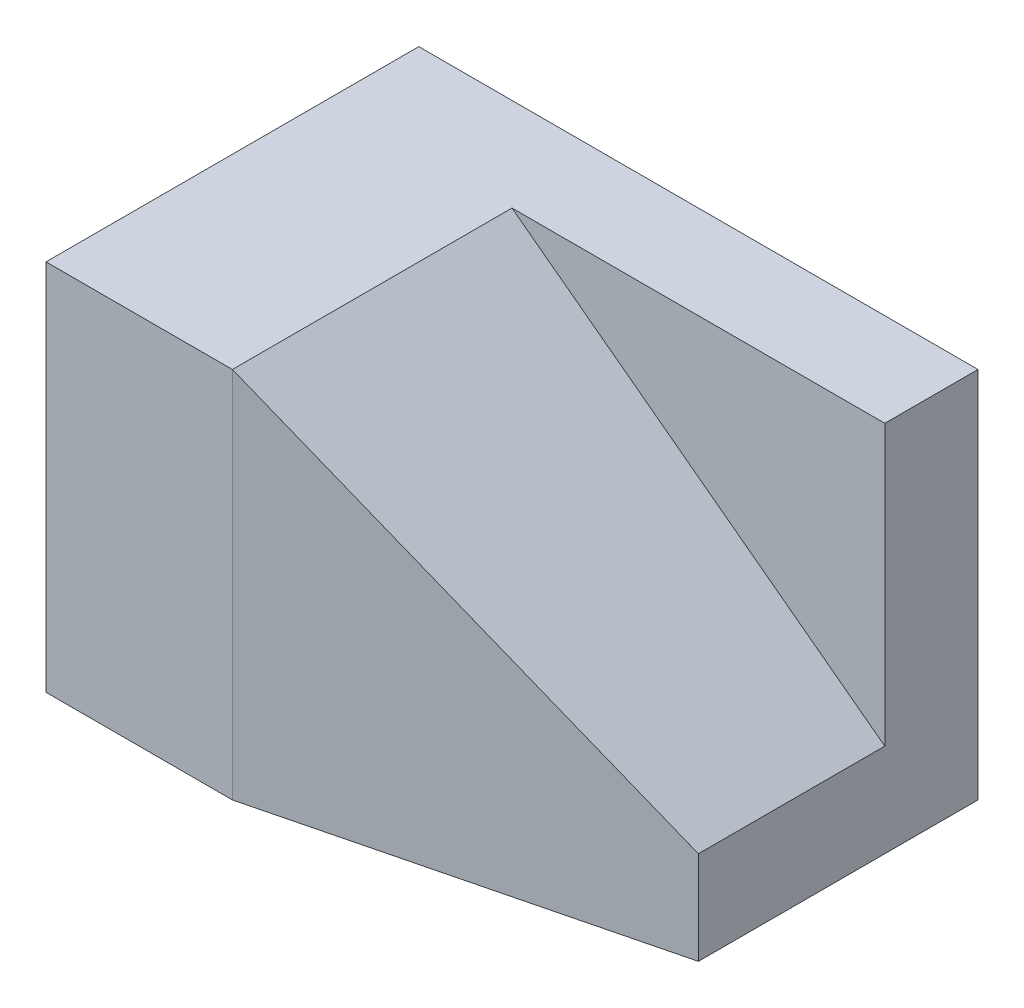
ISO-10303-21;
HEADER;
FILE_DESCRIPTION(('STEP AP214'),'2;1');
FILE_NAME('part.step','',(''),(''),'','','');
FILE_SCHEMA(('AUTOMOTIVE_DESIGN { 1 0 10303 214 1 1 1 1 }'));
ENDSEC;
DATA;
#1=APPLICATION_CONTEXT('core data for automotive mechanical design processes');
#2=APPLICATION_PROTOCOL_DEFINITION('international standard','automotive_design',2000,#1);
#3=PRODUCT_CONTEXT('',#1,'mechanical');
#4=PRODUCT('Part','Part','',(#3));
#5=PRODUCT_RELATED_PRODUCT_CATEGORY('part','',(#4));
#6=PRODUCT_DEFINITION_FORMATION('','',#4);
#7=PRODUCT_DEFINITION_CONTEXT('part definition',#1,'design');
#8=PRODUCT_DEFINITION('design','',#6,#7);
#9=PRODUCT_DEFINITION_SHAPE('','',#8);
#10=(LENGTH_UNIT() NAMED_UNIT(*) SI_UNIT(.MILLI.,.METRE.));
#11=(NAMED_UNIT(*) PLANE_ANGLE_UNIT() SI_UNIT($,.RADIAN.));
#12=(NAMED_UNIT(*) SI_UNIT($,.STERADIAN.) SOLID_ANGLE_UNIT());
#13=UNCERTAINTY_MEASURE_WITH_UNIT(LENGTH_MEASURE(1.E-05),#10,'distance_accuracy_value','');
#14=(GEOMETRIC_REPRESENTATION_CONTEXT(3) GLOBAL_UNCERTAINTY_ASSIGNED_CONTEXT((#13)) GLOBAL_UNIT_ASSIGNED_CONTEXT((#10,
#11,#12)) REPRESENTATION_CONTEXT('',''));
#15=CARTESIAN_POINT('',(0.,0.,0.));
#16=DIRECTION('',(0.,0.,1.));
#17=DIRECTION('',(1.,0.,0.));
#18=AXIS2_PLACEMENT_3D('',#15,#16,#17);
#19=CARTESIAN_POINT('',(2.05882352941177,20.,8.23529411764706));
#20=DIRECTION('',(-0.242535625036333,0.,-0.970142500145332));
#21=DIRECTION('',(-0.970142500145332,0.,0.242535625036333));
#22=AXIS2_PLACEMENT_3D('',#19,#20,#21);
#23=PLANE('',#22);
#24=DIRECTION('',(0.,-1.,0.));
#25=VECTOR('',#24,1.);
#26=CARTESIAN_POINT('',(15.,20.,5.));
#27=LINE('',#26,#25);
#28=CARTESIAN_POINT('',(15.,5.,5.));
#29=VERTEX_POINT('',#28);
#30=CARTESIAN_POINT('',(15.,0.,5.));
#31=VERTEX_POINT('',#30);
#32=EDGE_CURVE('E46',#29,#31,#27,.T.);
#33=ORIENTED_EDGE('',*,*,#32,.F.);
#34=DIRECTION('',(-0.784464540552736,0.588348405414552,0.196116135138184));
#35=VECTOR('',#34,1.);
#36=CARTESIAN_POINT('',(-0.384615384615384,16.5384615384615,8.84615384615385));
#37=LINE('',#36,#35);
#38=CARTESIAN_POINT('',(-5.,20.,10.));
#39=VERTEX_POINT('',#38);
#40=EDGE_CURVE('E110',#29,#39,#37,.T.);
#41=ORIENTED_EDGE('',*,*,#40,.T.);
#42=DIRECTION('',(0.,-1.,0.));
#43=VECTOR('',#42,1.);
#44=CARTESIAN_POINT('',(-5.,20.,10.));
#45=LINE('',#44,#43);
#46=CARTESIAN_POINT('',(-5.,0.,10.));
#47=VERTEX_POINT('',#46);
#48=EDGE_CURVE('E11',#39,#47,#45,.T.);
#49=ORIENTED_EDGE('',*,*,#48,.T.);
#50=DIRECTION('',(0.970142500145332,0.,-0.242535625036333));
#51=VECTOR('',#50,1.);
#52=CARTESIAN_POINT('',(2.05882352941177,0.,8.23529411764706));
#53=LINE('',#52,#51);
#54=EDGE_CURVE('E136',#47,#31,#53,.T.);
#55=ORIENTED_EDGE('',*,*,#54,.T.);
#56=EDGE_LOOP('',(#33,#41,#49,#55));
#57=FACE_BOUND('',#56,.T.);
#58=ADVANCED_FACE('F39',(#57),#23,.F.);
#59=CARTESIAN_POINT('',(15.,20.,0.));
#60=DIRECTION('',(1.,0.,0.));
#61=DIRECTION('',(0.,0.,-1.));
#62=AXIS2_PLACEMENT_3D('',#59,#60,#61);
#63=PLANE('',#62);
#64=DIRECTION('',(0.,0.,1.));
#65=VECTOR('',#64,1.);
#66=CARTESIAN_POINT('',(15.,5.,-5.));
#67=LINE('',#66,#65);
#68=CARTESIAN_POINT('',(15.,5.,-5.));
#69=VERTEX_POINT('',#68);
#70=EDGE_CURVE('E98',#69,#29,#67,.T.);
#71=ORIENTED_EDGE('',*,*,#70,.T.);
#72=ORIENTED_EDGE('',*,*,#32,.T.);
#73=DIRECTION('',(0.,0.,1.));
#74=VECTOR('',#73,1.);
#75=CARTESIAN_POINT('',(15.,0.,0.));
#76=LINE('',#75,#74);
#77=CARTESIAN_POINT('',(15.,0.,-10.));
#78=VERTEX_POINT('',#77);
#79=EDGE_CURVE('E139',#78,#31,#76,.T.);
#80=ORIENTED_EDGE('',*,*,#79,.F.);
#81=DIRECTION('',(0.,-1.,0.));
#82=VECTOR('',#81,1.);
#83=CARTESIAN_POINT('',(15.,20.,-10.));
#84=LINE('',#83,#82);
#85=CARTESIAN_POINT('',(15.,20.,-10.));
#86=VERTEX_POINT('',#85);
#87=EDGE_CURVE('E133',#86,#78,#84,.T.);
#88=ORIENTED_EDGE('',*,*,#87,.F.);
#89=DIRECTION('',(0.,0.,1.));
#90=VECTOR('',#89,1.);
#91=CARTESIAN_POINT('',(15.,20.,0.));
#92=LINE('',#91,#90);
#93=CARTESIAN_POINT('',(15.,20.,-5.));
#94=VERTEX_POINT('',#93);
#95=EDGE_CURVE('E137',#86,#94,#92,.T.);
#96=ORIENTED_EDGE('',*,*,#95,.T.);
#97=DIRECTION('',(0.,1.,0.));
#98=VECTOR('',#97,1.);
#99=CARTESIAN_POINT('',(15.,5.,-5.));
#100=LINE('',#99,#98);
#101=EDGE_CURVE('E53',#69,#94,#100,.T.);
#102=ORIENTED_EDGE('',*,*,#101,.F.);
#103=EDGE_LOOP('',(#71,#72,#80,#88,#96,#102));
#104=FACE_BOUND('',#103,.T.);
#105=ADVANCED_FACE('F149',(#104),#63,.T.);
#106=CARTESIAN_POINT('',(0.,20.,0.));
#107=DIRECTION('',(0.,1.,0.));
#108=DIRECTION('',(0.,0.,1.));
#109=AXIS2_PLACEMENT_3D('',#106,#107,#108);
#110=PLANE('',#109);
#111=DIRECTION('',(0.,0.,1.));
#112=VECTOR('',#111,1.);
#113=CARTESIAN_POINT('',(-5.,20.,-5.));
#114=LINE('',#113,#112);
#115=CARTESIAN_POINT('',(-5.,20.,-5.));
#116=VERTEX_POINT('',#115);
#117=EDGE_CURVE('E96',#116,#39,#114,.T.);
#118=ORIENTED_EDGE('',*,*,#117,.F.);
#119=DIRECTION('',(-1.,0.,0.));
#120=VECTOR('',#119,1.);
#121=CARTESIAN_POINT('',(15.,20.,-5.));
#122=LINE('',#121,#120);
#123=EDGE_CURVE('E99',#94,#116,#122,.T.);
#124=ORIENTED_EDGE('',*,*,#123,.F.);
#125=ORIENTED_EDGE('',*,*,#95,.F.);
#126=DIRECTION('',(-1.,0.,0.));
#127=VECTOR('',#126,1.);
#128=CARTESIAN_POINT('',(0.,20.,-10.));
#129=LINE('',#128,#127);
#130=CARTESIAN_POINT('',(-15.,20.,-10.));
#131=VERTEX_POINT('',#130);
#132=EDGE_CURVE('E117',#86,#131,#129,.T.);
#133=ORIENTED_EDGE('',*,*,#132,.T.);
#134=DIRECTION('',(0.,0.,1.));
#135=VECTOR('',#134,1.);
#136=CARTESIAN_POINT('',(-15.,20.,0.));
#137=LINE('',#136,#135);
#138=CARTESIAN_POINT('',(-15.,20.,10.));
#139=VERTEX_POINT('',#138);
#140=EDGE_CURVE('E120',#131,#139,#137,.T.);
#141=ORIENTED_EDGE('',*,*,#140,.T.);
#142=DIRECTION('',(-1.,0.,0.));
#143=VECTOR('',#142,1.);
#144=CARTESIAN_POINT('',(0.,20.,10.));
#145=LINE('',#144,#143);
#146=EDGE_CURVE('E108',#39,#139,#145,.T.);
#147=ORIENTED_EDGE('',*,*,#146,.F.);
#148=EDGE_LOOP('',(#118,#124,#125,#133,#141,#147));
#149=FACE_BOUND('',#148,.T.);
#150=ADVANCED_FACE('F106',(#149),#110,.T.);
#151=CARTESIAN_POINT('',(0.,0.,0.));
#152=DIRECTION('',(0.,1.,0.));
#153=DIRECTION('',(0.,0.,1.));
#154=AXIS2_PLACEMENT_3D('',#151,#152,#153);
#155=PLANE('',#154);
#156=ORIENTED_EDGE('',*,*,#54,.F.);
#157=DIRECTION('',(-1.,0.,0.));
#158=VECTOR('',#157,1.);
#159=CARTESIAN_POINT('',(0.,0.,10.));
#160=LINE('',#159,#158);
#161=CARTESIAN_POINT('',(-15.,0.,10.));
#162=VERTEX_POINT('',#161);
#163=EDGE_CURVE('E115',#47,#162,#160,.T.);
#164=ORIENTED_EDGE('',*,*,#163,.T.);
#165=DIRECTION('',(0.,0.,1.));
#166=VECTOR('',#165,1.);
#167=CARTESIAN_POINT('',(-15.,0.,0.));
#168=LINE('',#167,#166);
#169=CARTESIAN_POINT('',(-15.,0.,-10.));
#170=VERTEX_POINT('',#169);
#171=EDGE_CURVE('E118',#170,#162,#168,.T.);
#172=ORIENTED_EDGE('',*,*,#171,.F.);
#173=DIRECTION('',(-1.,0.,0.));
#174=VECTOR('',#173,1.);
#175=CARTESIAN_POINT('',(0.,0.,-10.));
#176=LINE('',#175,#174);
#177=EDGE_CURVE('E125',#78,#170,#176,.T.);
#178=ORIENTED_EDGE('',*,*,#177,.F.);
#179=ORIENTED_EDGE('',*,*,#79,.T.);
#180=EDGE_LOOP('',(#156,#164,#172,#178,#179));
#181=FACE_BOUND('',#180,.T.);
#182=ADVANCED_FACE('F145',(#181),#155,.F.);
#183=CARTESIAN_POINT('',(0.,20.,10.));
#184=DIRECTION('',(0.,0.,1.));
#185=DIRECTION('',(1.,0.,0.));
#186=AXIS2_PLACEMENT_3D('',#183,#184,#185);
#187=PLANE('',#186);
#188=ORIENTED_EDGE('',*,*,#163,.F.);
#189=ORIENTED_EDGE('',*,*,#48,.F.);
#190=ORIENTED_EDGE('',*,*,#146,.T.);
#191=DIRECTION('',(0.,-1.,0.));
#192=VECTOR('',#191,1.);
#193=CARTESIAN_POINT('',(-15.,20.,10.));
#194=LINE('',#193,#192);
#195=EDGE_CURVE('E122',#139,#162,#194,.T.);
#196=ORIENTED_EDGE('',*,*,#195,.T.);
#197=EDGE_LOOP('',(#188,#189,#190,#196));
#198=FACE_BOUND('',#197,.T.);
#199=ADVANCED_FACE('F159',(#198),#187,.T.);
#200=CARTESIAN_POINT('',(0.,20.,-10.));
#201=DIRECTION('',(0.,0.,1.));
#202=DIRECTION('',(1.,0.,0.));
#203=AXIS2_PLACEMENT_3D('',#200,#201,#202);
#204=PLANE('',#203);
#205=ORIENTED_EDGE('',*,*,#177,.T.);
#206=DIRECTION('',(0.,-1.,0.));
#207=VECTOR('',#206,1.);
#208=CARTESIAN_POINT('',(-15.,20.,-10.));
#209=LINE('',#208,#207);
#210=EDGE_CURVE('E130',#131,#170,#209,.T.);
#211=ORIENTED_EDGE('',*,*,#210,.F.);
#212=ORIENTED_EDGE('',*,*,#132,.F.);
#213=ORIENTED_EDGE('',*,*,#87,.T.);
#214=EDGE_LOOP('',(#205,#211,#212,#213));
#215=FACE_BOUND('',#214,.T.);
#216=ADVANCED_FACE('F152',(#215),#204,.F.);
#217=CARTESIAN_POINT('',(-15.,20.,0.));
#218=DIRECTION('',(1.,0.,0.));
#219=DIRECTION('',(0.,0.,-1.));
#220=AXIS2_PLACEMENT_3D('',#217,#218,#219);
#221=PLANE('',#220);
#222=ORIENTED_EDGE('',*,*,#171,.T.);
#223=ORIENTED_EDGE('',*,*,#195,.F.);
#224=ORIENTED_EDGE('',*,*,#140,.F.);
#225=ORIENTED_EDGE('',*,*,#210,.T.);
#226=EDGE_LOOP('',(#222,#223,#224,#225));
#227=FACE_BOUND('',#226,.T.);
#228=ADVANCED_FACE('F161',(#227),#221,.F.);
#229=CARTESIAN_POINT('',(-5.,20.,-5.));
#230=DIRECTION('',(-0.6,-0.8,0.));
#231=DIRECTION('',(0.8,-0.6,0.));
#232=AXIS2_PLACEMENT_3D('',#229,#230,#231);
#233=PLANE('',#232);
#234=ORIENTED_EDGE('',*,*,#70,.F.);
#235=DIRECTION('',(0.8,-0.6,0.));
#236=VECTOR('',#235,1.);
#237=CARTESIAN_POINT('',(-5.,20.,-5.));
#238=LINE('',#237,#236);
#239=EDGE_CURVE('E93',#116,#69,#238,.T.);
#240=ORIENTED_EDGE('',*,*,#239,.F.);
#241=ORIENTED_EDGE('',*,*,#117,.T.);
#242=ORIENTED_EDGE('',*,*,#40,.F.);
#243=EDGE_LOOP('',(#234,#240,#241,#242));
#244=FACE_BOUND('',#243,.T.);
#245=ADVANCED_FACE('F94',(#244),#233,.F.);
#246=CARTESIAN_POINT('',(0.,0.,-5.));
#247=DIRECTION('',(0.,0.,-1.));
#248=DIRECTION('',(-1.,0.,0.));
#249=AXIS2_PLACEMENT_3D('',#246,#247,#248);
#250=PLANE('',#249);
#251=ORIENTED_EDGE('',*,*,#123,.T.);
#252=ORIENTED_EDGE('',*,*,#239,.T.);
#253=ORIENTED_EDGE('',*,*,#101,.T.);
#254=EDGE_LOOP('',(#251,#252,#253));
#255=FACE_BOUND('',#254,.T.);
#256=ADVANCED_FACE('F101',(#255),#250,.F.);
#257=CLOSED_SHELL('',(#58,#105,#150,#182,#199,#216,#228,#245,#256));
#258=MANIFOLD_SOLID_BREP('B2',#257);
#259=ADVANCED_BREP_SHAPE_REPRESENTATION('',(#18,#258),#14);
#260=SHAPE_DEFINITION_REPRESENTATION(#9,#259);
ENDSEC;
END-ISO-10303-21;
